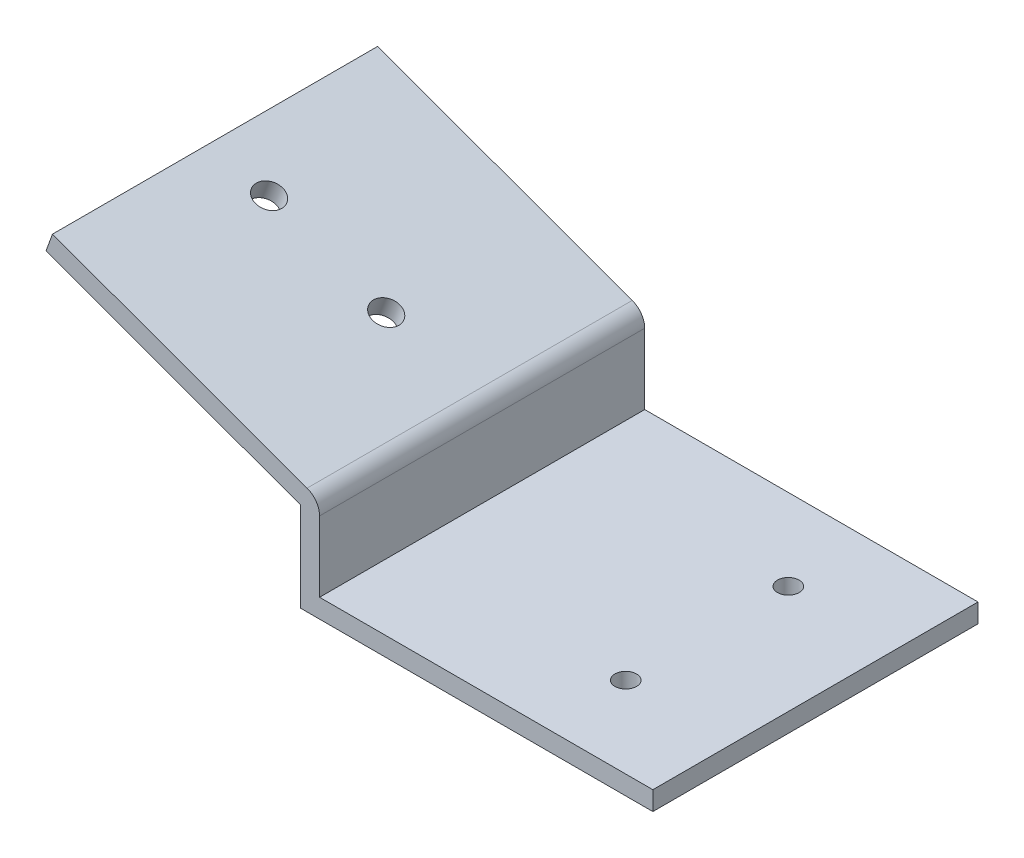
ISO-10303-21;
HEADER;
FILE_DESCRIPTION(('STEP AP214'),'2;1');
FILE_NAME('part.step','',(''),(''),'','','');
FILE_SCHEMA(('AUTOMOTIVE_DESIGN { 1 0 10303 214 1 1 1 1 }'));
ENDSEC;
DATA;
#1=APPLICATION_CONTEXT('core data for automotive mechanical design processes');
#2=APPLICATION_PROTOCOL_DEFINITION('international standard','automotive_design',2000,#1);
#3=PRODUCT_CONTEXT('',#1,'mechanical');
#4=PRODUCT('Part','Part','',(#3));
#5=PRODUCT_RELATED_PRODUCT_CATEGORY('part','',(#4));
#6=PRODUCT_DEFINITION_FORMATION('','',#4);
#7=PRODUCT_DEFINITION_CONTEXT('part definition',#1,'design');
#8=PRODUCT_DEFINITION('design','',#6,#7);
#9=PRODUCT_DEFINITION_SHAPE('','',#8);
#10=(LENGTH_UNIT() NAMED_UNIT(*) SI_UNIT(.MILLI.,.METRE.));
#11=(NAMED_UNIT(*) PLANE_ANGLE_UNIT() SI_UNIT($,.RADIAN.));
#12=(NAMED_UNIT(*) SI_UNIT($,.STERADIAN.) SOLID_ANGLE_UNIT());
#13=UNCERTAINTY_MEASURE_WITH_UNIT(LENGTH_MEASURE(1.E-05),#10,'distance_accuracy_value','');
#14=(GEOMETRIC_REPRESENTATION_CONTEXT(3) GLOBAL_UNCERTAINTY_ASSIGNED_CONTEXT((#13)) GLOBAL_UNIT_ASSIGNED_CONTEXT((#10,
#11,#12)) REPRESENTATION_CONTEXT('',''));
#15=CARTESIAN_POINT('',(0.,0.,0.));
#16=DIRECTION('',(0.,0.,1.));
#17=DIRECTION('',(1.,0.,0.));
#18=AXIS2_PLACEMENT_3D('',#15,#16,#17);
#19=CARTESIAN_POINT('',(0.,3.5,0.));
#20=DIRECTION('',(1.,0.,0.));
#21=DIRECTION('',(0.,0.,-1.));
#22=AXIS2_PLACEMENT_3D('',#19,#20,#21);
#23=PLANE('',#22);
#24=DIRECTION('',(0.,0.,1.));
#25=VECTOR('',#24,1.);
#26=CARTESIAN_POINT('',(0.,0.,0.));
#27=LINE('',#26,#25);
#28=CARTESIAN_POINT('',(0.,0.,0.));
#29=VERTEX_POINT('',#28);
#30=CARTESIAN_POINT('',(0.,0.,60.));
#31=VERTEX_POINT('',#30);
#32=EDGE_CURVE('E100',#29,#31,#27,.T.);
#33=ORIENTED_EDGE('',*,*,#32,.T.);
#34=DIRECTION('',(0.,-1.,0.));
#35=VECTOR('',#34,1.);
#36=CARTESIAN_POINT('',(0.,3.5,60.));
#37=LINE('',#36,#35);
#38=CARTESIAN_POINT('',(0.,16.5,60.));
#39=VERTEX_POINT('',#38);
#40=EDGE_CURVE('E11',#39,#31,#37,.T.);
#41=ORIENTED_EDGE('',*,*,#40,.F.);
#42=DIRECTION('',(0.,0.,1.));
#43=VECTOR('',#42,1.);
#44=CARTESIAN_POINT('',(0.,16.5,0.));
#45=LINE('',#44,#43);
#46=CARTESIAN_POINT('',(0.,16.5,0.));
#47=VERTEX_POINT('',#46);
#48=EDGE_CURVE('E102',#47,#39,#45,.T.);
#49=ORIENTED_EDGE('',*,*,#48,.F.);
#50=DIRECTION('',(0.,-1.,0.));
#51=VECTOR('',#50,1.);
#52=CARTESIAN_POINT('',(0.,3.5,0.));
#53=LINE('',#52,#51);
#54=EDGE_CURVE('E86',#47,#29,#53,.T.);
#55=ORIENTED_EDGE('',*,*,#54,.T.);
#56=EDGE_LOOP('',(#33,#41,#49,#55));
#57=FACE_BOUND('',#56,.T.);
#58=ADVANCED_FACE('F39',(#57),#23,.F.);
#59=CARTESIAN_POINT('',(0.,3.5,60.));
#60=DIRECTION('',(0.,0.,-1.));
#61=DIRECTION('',(-1.,0.,0.));
#62=AXIS2_PLACEMENT_3D('',#59,#60,#61);
#63=PLANE('',#62);
#64=DIRECTION('',(1.,0.,0.));
#65=VECTOR('',#64,1.);
#66=CARTESIAN_POINT('',(0.,0.,60.));
#67=LINE('',#66,#65);
#68=CARTESIAN_POINT('',(65.,0.,60.));
#69=VERTEX_POINT('',#68);
#70=EDGE_CURVE('E108',#31,#69,#67,.T.);
#71=ORIENTED_EDGE('',*,*,#70,.T.);
#72=DIRECTION('',(0.,-1.,0.));
#73=VECTOR('',#72,1.);
#74=CARTESIAN_POINT('',(65.,3.5,60.));
#75=LINE('',#74,#73);
#76=CARTESIAN_POINT('',(65.,3.5,60.));
#77=VERTEX_POINT('',#76);
#78=EDGE_CURVE('E48',#77,#69,#75,.T.);
#79=ORIENTED_EDGE('',*,*,#78,.F.);
#80=DIRECTION('',(1.,0.,0.));
#81=VECTOR('',#80,1.);
#82=CARTESIAN_POINT('',(0.,3.5,60.));
#83=LINE('',#82,#81);
#84=CARTESIAN_POINT('',(3.5,3.5,60.));
#85=VERTEX_POINT('',#84);
#86=EDGE_CURVE('E94',#85,#77,#83,.T.);
#87=ORIENTED_EDGE('',*,*,#86,.F.);
#88=DIRECTION('',(0.,-1.,0.));
#89=VECTOR('',#88,1.);
#90=CARTESIAN_POINT('',(3.50000000000001,16.5,60.));
#91=LINE('',#90,#89);
#92=CARTESIAN_POINT('',(3.50000000000001,16.5,60.));
#93=VERTEX_POINT('',#92);
#94=EDGE_CURVE('E110',#93,#85,#91,.T.);
#95=ORIENTED_EDGE('',*,*,#94,.F.);
#96=CARTESIAN_POINT('',(0.,16.5,60.));
#97=DIRECTION('',(0.,0.,1.));
#98=DIRECTION('',(-1.,0.,0.));
#99=AXIS2_PLACEMENT_3D('',#96,#97,#98);
#100=CIRCLE('',#99,3.50000000000002);
#101=CARTESIAN_POINT('',(1.19707050163985,19.7889241727507,60.));
#102=VERTEX_POINT('',#101);
#103=EDGE_CURVE('E136',#93,#102,#100,.T.);
#104=ORIENTED_EDGE('',*,*,#103,.T.);
#105=DIRECTION('',(-0.939692620785907,0.342020143325672,0.));
#106=VECTOR('',#105,1.);
#107=CARTESIAN_POINT('',(-45.7875605376555,36.8899313390343,60.));
#108=LINE('',#107,#106);
#109=CARTESIAN_POINT('',(-45.7875605376555,36.8899313390343,60.));
#110=VERTEX_POINT('',#109);
#111=EDGE_CURVE('E169',#102,#110,#108,.T.);
#112=ORIENTED_EDGE('',*,*,#111,.T.);
#113=DIRECTION('',(-0.342020143325673,-0.939692620785907,0.));
#114=VECTOR('',#113,1.);
#115=CARTESIAN_POINT('',(-46.9846310392954,33.6010071662836,60.));
#116=LINE('',#115,#114);
#117=CARTESIAN_POINT('',(-46.9846310392954,33.6010071662836,60.));
#118=VERTEX_POINT('',#117);
#119=EDGE_CURVE('E173',#110,#118,#116,.T.);
#120=ORIENTED_EDGE('',*,*,#119,.T.);
#121=DIRECTION('',(0.939692620785907,-0.342020143325673,0.));
#122=VECTOR('',#121,1.);
#123=CARTESIAN_POINT('',(0.,16.5,60.));
#124=LINE('',#123,#122);
#125=EDGE_CURVE('E154',#118,#39,#124,.T.);
#126=ORIENTED_EDGE('',*,*,#125,.T.);
#127=ORIENTED_EDGE('',*,*,#40,.T.);
#128=EDGE_LOOP('',(#71,#79,#87,#95,#104,#112,#120,#126,#127));
#129=FACE_BOUND('',#128,.T.);
#130=ADVANCED_FACE('F246',(#129),#63,.F.);
#131=CARTESIAN_POINT('',(65.,3.5,0.));
#132=DIRECTION('',(-1.,0.,0.));
#133=DIRECTION('',(0.,0.,1.));
#134=AXIS2_PLACEMENT_3D('',#131,#132,#133);
#135=PLANE('',#134);
#136=DIRECTION('',(0.,0.,-1.));
#137=VECTOR('',#136,1.);
#138=CARTESIAN_POINT('',(65.,0.,0.));
#139=LINE('',#138,#137);
#140=CARTESIAN_POINT('',(65.,0.,0.));
#141=VERTEX_POINT('',#140);
#142=EDGE_CURVE('E95',#69,#141,#139,.T.);
#143=ORIENTED_EDGE('',*,*,#142,.T.);
#144=DIRECTION('',(0.,-1.,0.));
#145=VECTOR('',#144,1.);
#146=CARTESIAN_POINT('',(65.,3.5,0.));
#147=LINE('',#146,#145);
#148=CARTESIAN_POINT('',(65.,3.5,0.));
#149=VERTEX_POINT('',#148);
#150=EDGE_CURVE('E89',#149,#141,#147,.T.);
#151=ORIENTED_EDGE('',*,*,#150,.F.);
#152=DIRECTION('',(0.,0.,-1.));
#153=VECTOR('',#152,1.);
#154=CARTESIAN_POINT('',(65.,3.5,0.));
#155=LINE('',#154,#153);
#156=EDGE_CURVE('E62',#77,#149,#155,.T.);
#157=ORIENTED_EDGE('',*,*,#156,.F.);
#158=ORIENTED_EDGE('',*,*,#78,.T.);
#159=EDGE_LOOP('',(#143,#151,#157,#158));
#160=FACE_BOUND('',#159,.T.);
#161=ADVANCED_FACE('F253',(#160),#135,.F.);
#162=CARTESIAN_POINT('',(0.,3.5,0.));
#163=DIRECTION('',(0.,0.,1.));
#164=DIRECTION('',(1.,0.,0.));
#165=AXIS2_PLACEMENT_3D('',#162,#163,#164);
#166=PLANE('',#165);
#167=DIRECTION('',(-1.,0.,0.));
#168=VECTOR('',#167,1.);
#169=CARTESIAN_POINT('',(0.,0.,0.));
#170=LINE('',#169,#168);
#171=EDGE_CURVE('E82',#141,#29,#170,.T.);
#172=ORIENTED_EDGE('',*,*,#171,.T.);
#173=ORIENTED_EDGE('',*,*,#54,.F.);
#174=DIRECTION('',(0.939692620785907,-0.342020143325673,0.));
#175=VECTOR('',#174,1.);
#176=CARTESIAN_POINT('',(0.,16.5,0.));
#177=LINE('',#176,#175);
#178=CARTESIAN_POINT('',(-46.9846310392954,33.6010071662836,0.));
#179=VERTEX_POINT('',#178);
#180=EDGE_CURVE('E162',#179,#47,#177,.T.);
#181=ORIENTED_EDGE('',*,*,#180,.F.);
#182=DIRECTION('',(-0.342020143325673,-0.939692620785907,0.));
#183=VECTOR('',#182,1.);
#184=CARTESIAN_POINT('',(-46.9846310392954,33.6010071662836,0.));
#185=LINE('',#184,#183);
#186=CARTESIAN_POINT('',(-45.7875605376555,36.8899313390343,0.));
#187=VERTEX_POINT('',#186);
#188=EDGE_CURVE('E158',#187,#179,#185,.T.);
#189=ORIENTED_EDGE('',*,*,#188,.F.);
#190=DIRECTION('',(-0.939692620785907,0.342020143325672,0.));
#191=VECTOR('',#190,1.);
#192=CARTESIAN_POINT('',(-45.7875605376555,36.8899313390343,0.));
#193=LINE('',#192,#191);
#194=CARTESIAN_POINT('',(1.19707050163985,19.7889241727507,0.));
#195=VERTEX_POINT('',#194);
#196=EDGE_CURVE('E153',#195,#187,#193,.T.);
#197=ORIENTED_EDGE('',*,*,#196,.F.);
#198=CARTESIAN_POINT('',(0.,16.5,0.));
#199=DIRECTION('',(0.,0.,1.));
#200=DIRECTION('',(-1.,0.,0.));
#201=AXIS2_PLACEMENT_3D('',#198,#199,#200);
#202=CIRCLE('',#201,3.50000000000002);
#203=CARTESIAN_POINT('',(3.5,16.5,0.));
#204=VERTEX_POINT('',#203);
#205=EDGE_CURVE('E149',#204,#195,#202,.T.);
#206=ORIENTED_EDGE('',*,*,#205,.F.);
#207=DIRECTION('',(0.,-1.,0.));
#208=VECTOR('',#207,1.);
#209=CARTESIAN_POINT('',(3.5,16.5,0.));
#210=LINE('',#209,#208);
#211=CARTESIAN_POINT('',(3.5,3.5,0.));
#212=VERTEX_POINT('',#211);
#213=EDGE_CURVE('E116',#204,#212,#210,.T.);
#214=ORIENTED_EDGE('',*,*,#213,.T.);
#215=DIRECTION('',(-1.,0.,0.));
#216=VECTOR('',#215,1.);
#217=CARTESIAN_POINT('',(0.,3.5,0.));
#218=LINE('',#217,#216);
#219=EDGE_CURVE('E105',#149,#212,#218,.T.);
#220=ORIENTED_EDGE('',*,*,#219,.F.);
#221=ORIENTED_EDGE('',*,*,#150,.T.);
#222=EDGE_LOOP('',(#172,#173,#181,#189,#197,#206,#214,#220,#221));
#223=FACE_BOUND('',#222,.T.);
#224=ADVANCED_FACE('F84',(#223),#166,.F.);
#225=CARTESIAN_POINT('',(0.,3.5,0.));
#226=DIRECTION('',(0.,1.,0.));
#227=DIRECTION('',(0.,0.,1.));
#228=AXIS2_PLACEMENT_3D('',#225,#226,#227);
#229=PLANE('',#228);
#230=CARTESIAN_POINT('',(45.,3.5,15.));
#231=DIRECTION('',(0.,1.,0.));
#232=DIRECTION('',(0.,0.,1.));
#233=AXIS2_PLACEMENT_3D('',#230,#231,#232);
#234=CIRCLE('',#233,2.);
#235=CARTESIAN_POINT('',(45.,3.5,17.));
#236=VERTEX_POINT('',#235);
#237=EDGE_CURVE('E130',#236,#236,#234,.T.);
#238=ORIENTED_EDGE('',*,*,#237,.F.);
#239=EDGE_LOOP('',(#238));
#240=FACE_BOUND('',#239,.T.);
#241=CARTESIAN_POINT('',(45.,3.5,45.));
#242=DIRECTION('',(0.,1.,0.));
#243=DIRECTION('',(0.,0.,1.));
#244=AXIS2_PLACEMENT_3D('',#241,#242,#243);
#245=CIRCLE('',#244,2.);
#246=CARTESIAN_POINT('',(45.,3.5,47.));
#247=VERTEX_POINT('',#246);
#248=EDGE_CURVE('E138',#247,#247,#245,.T.);
#249=ORIENTED_EDGE('',*,*,#248,.F.);
#250=EDGE_LOOP('',(#249));
#251=FACE_BOUND('',#250,.T.);
#252=DIRECTION('',(0.,0.,-1.));
#253=VECTOR('',#252,1.);
#254=CARTESIAN_POINT('',(3.5,3.5,0.));
#255=LINE('',#254,#253);
#256=EDGE_CURVE('E56',#85,#212,#255,.T.);
#257=ORIENTED_EDGE('',*,*,#256,.F.);
#258=ORIENTED_EDGE('',*,*,#86,.T.);
#259=ORIENTED_EDGE('',*,*,#156,.T.);
#260=ORIENTED_EDGE('',*,*,#219,.T.);
#261=EDGE_LOOP('',(#257,#258,#259,#260));
#262=FACE_BOUND('',#261,.T.);
#263=ADVANCED_FACE('F206',(#240,#251,#262),#229,.T.);
#264=CARTESIAN_POINT('',(0.,0.,0.));
#265=DIRECTION('',(0.,1.,0.));
#266=DIRECTION('',(0.,0.,1.));
#267=AXIS2_PLACEMENT_3D('',#264,#265,#266);
#268=PLANE('',#267);
#269=CARTESIAN_POINT('',(45.,0.,15.));
#270=DIRECTION('',(0.,1.,0.));
#271=DIRECTION('',(0.,0.,1.));
#272=AXIS2_PLACEMENT_3D('',#269,#270,#271);
#273=CIRCLE('',#272,2.);
#274=CARTESIAN_POINT('',(45.,0.,17.));
#275=VERTEX_POINT('',#274);
#276=EDGE_CURVE('E42',#275,#275,#273,.T.);
#277=ORIENTED_EDGE('',*,*,#276,.T.);
#278=EDGE_LOOP('',(#277));
#279=FACE_BOUND('',#278,.T.);
#280=CARTESIAN_POINT('',(45.,0.,45.));
#281=DIRECTION('',(0.,1.,0.));
#282=DIRECTION('',(0.,0.,1.));
#283=AXIS2_PLACEMENT_3D('',#280,#281,#282);
#284=CIRCLE('',#283,2.);
#285=CARTESIAN_POINT('',(45.,0.,47.));
#286=VERTEX_POINT('',#285);
#287=EDGE_CURVE('E127',#286,#286,#284,.T.);
#288=ORIENTED_EDGE('',*,*,#287,.T.);
#289=EDGE_LOOP('',(#288));
#290=FACE_BOUND('',#289,.T.);
#291=ORIENTED_EDGE('',*,*,#32,.F.);
#292=ORIENTED_EDGE('',*,*,#171,.F.);
#293=ORIENTED_EDGE('',*,*,#142,.F.);
#294=ORIENTED_EDGE('',*,*,#70,.F.);
#295=EDGE_LOOP('',(#291,#292,#293,#294));
#296=FACE_BOUND('',#295,.T.);
#297=ADVANCED_FACE('F107',(#279,#290,#296),#268,.F.);
#298=CARTESIAN_POINT('',(3.5,16.5,0.));
#299=DIRECTION('',(-1.,0.,0.));
#300=DIRECTION('',(0.,0.,1.));
#301=AXIS2_PLACEMENT_3D('',#298,#299,#300);
#302=PLANE('',#301);
#303=ORIENTED_EDGE('',*,*,#256,.T.);
#304=ORIENTED_EDGE('',*,*,#213,.F.);
#305=DIRECTION('',(0.,0.,-1.));
#306=VECTOR('',#305,1.);
#307=CARTESIAN_POINT('',(3.5,16.5,0.));
#308=LINE('',#307,#306);
#309=EDGE_CURVE('E193',#93,#204,#308,.T.);
#310=ORIENTED_EDGE('',*,*,#309,.F.);
#311=ORIENTED_EDGE('',*,*,#94,.T.);
#312=EDGE_LOOP('',(#303,#304,#310,#311));
#313=FACE_BOUND('',#312,.T.);
#314=ADVANCED_FACE('F211',(#313),#302,.F.);
#315=CARTESIAN_POINT('',(0.,16.5,0.));
#316=DIRECTION('',(-0.342020143325672,-0.939692620785907,0.));
#317=DIRECTION('',(0.939692620785907,-0.342020143325672,0.));
#318=AXIS2_PLACEMENT_3D('',#315,#316,#317);
#319=PLANE('',#318);
#320=CARTESIAN_POINT('',(-15.2191688728327,22.0393244599819,30.1812288760336));
#321=DIRECTION('',(-0.342020143325672,-0.939692620785907,0.));
#322=DIRECTION('',(0.939692620785907,-0.342020143325672,0.));
#323=AXIS2_PLACEMENT_3D('',#320,#321,#322);
#324=CIRCLE('',#323,2.5);
#325=CARTESIAN_POINT('',(-12.869937320868,21.1842741016677,30.1812288760336));
#326=VERTEX_POINT('',#325);
#327=EDGE_CURVE('E144',#326,#326,#324,.T.);
#328=ORIENTED_EDGE('',*,*,#327,.F.);
#329=EDGE_LOOP('',(#328));
#330=FACE_BOUND('',#329,.T.);
#331=CARTESIAN_POINT('',(-36.8320991509086,29.9057877564724,30.1812288760336));
#332=DIRECTION('',(-0.342020143325672,-0.939692620785907,0.));
#333=DIRECTION('',(0.939692620785907,-0.342020143325672,0.));
#334=AXIS2_PLACEMENT_3D('',#331,#332,#333);
#335=CIRCLE('',#334,2.5);
#336=CARTESIAN_POINT('',(-34.4828675989438,29.0507373981582,30.1812288760336));
#337=VERTEX_POINT('',#336);
#338=EDGE_CURVE('E391',#337,#337,#335,.T.);
#339=ORIENTED_EDGE('',*,*,#338,.F.);
#340=EDGE_LOOP('',(#339));
#341=FACE_BOUND('',#340,.T.);
#342=ORIENTED_EDGE('',*,*,#125,.F.);
#343=DIRECTION('',(0.,0.,1.));
#344=VECTOR('',#343,1.);
#345=CARTESIAN_POINT('',(-46.9846310392954,33.6010071662836,0.));
#346=LINE('',#345,#344);
#347=EDGE_CURVE('E180',#179,#118,#346,.T.);
#348=ORIENTED_EDGE('',*,*,#347,.F.);
#349=ORIENTED_EDGE('',*,*,#180,.T.);
#350=ORIENTED_EDGE('',*,*,#48,.T.);
#351=EDGE_LOOP('',(#342,#348,#349,#350));
#352=FACE_BOUND('',#351,.T.);
#353=ADVANCED_FACE('F245',(#330,#341,#352),#319,.T.);
#354=CARTESIAN_POINT('',(-46.9846310392954,33.6010071662836,0.));
#355=DIRECTION('',(-0.939692620785907,0.342020143325673,0.));
#356=DIRECTION('',(-0.342020143325673,-0.939692620785907,0.));
#357=AXIS2_PLACEMENT_3D('',#354,#355,#356);
#358=PLANE('',#357);
#359=ORIENTED_EDGE('',*,*,#119,.F.);
#360=DIRECTION('',(0.,0.,1.));
#361=VECTOR('',#360,1.);
#362=CARTESIAN_POINT('',(-45.7875605376555,36.8899313390343,0.));
#363=LINE('',#362,#361);
#364=EDGE_CURVE('E184',#187,#110,#363,.T.);
#365=ORIENTED_EDGE('',*,*,#364,.F.);
#366=ORIENTED_EDGE('',*,*,#188,.T.);
#367=ORIENTED_EDGE('',*,*,#347,.T.);
#368=EDGE_LOOP('',(#359,#365,#366,#367));
#369=FACE_BOUND('',#368,.T.);
#370=ADVANCED_FACE('F249',(#369),#358,.T.);
#371=CARTESIAN_POINT('',(-45.7875605376555,36.8899313390343,0.));
#372=DIRECTION('',(0.342020143325672,0.939692620785907,0.));
#373=DIRECTION('',(-0.939692620785907,0.342020143325672,0.));
#374=AXIS2_PLACEMENT_3D('',#371,#372,#373);
#375=PLANE('',#374);
#376=CARTESIAN_POINT('',(-14.0220983711929,25.3282486327326,30.1812288760336));
#377=DIRECTION('',(0.342020143325672,0.939692620785907,0.));
#378=DIRECTION('',(-0.939692620785907,0.342020143325672,0.));
#379=AXIS2_PLACEMENT_3D('',#376,#377,#378);
#380=CIRCLE('',#379,2.5);
#381=CARTESIAN_POINT('',(-16.3713299231576,26.1832989910468,30.1812288760336));
#382=VERTEX_POINT('',#381);
#383=EDGE_CURVE('E385',#382,#382,#380,.T.);
#384=ORIENTED_EDGE('',*,*,#383,.F.);
#385=EDGE_LOOP('',(#384));
#386=FACE_BOUND('',#385,.T.);
#387=CARTESIAN_POINT('',(-35.6350286492687,33.194711929223,30.1812288760336));
#388=DIRECTION('',(0.342020143325672,0.939692620785907,0.));
#389=DIRECTION('',(-0.939692620785907,0.342020143325672,0.));
#390=AXIS2_PLACEMENT_3D('',#387,#388,#389);
#391=CIRCLE('',#390,2.5);
#392=CARTESIAN_POINT('',(-37.9842602012335,34.0497622875372,30.1812288760336));
#393=VERTEX_POINT('',#392);
#394=EDGE_CURVE('E387',#393,#393,#391,.T.);
#395=ORIENTED_EDGE('',*,*,#394,.F.);
#396=EDGE_LOOP('',(#395));
#397=FACE_BOUND('',#396,.T.);
#398=ORIENTED_EDGE('',*,*,#111,.F.);
#399=DIRECTION('',(0.,0.,1.));
#400=VECTOR('',#399,1.);
#401=CARTESIAN_POINT('',(1.19707050163985,19.7889241727507,0.));
#402=LINE('',#401,#400);
#403=EDGE_CURVE('E165',#195,#102,#402,.T.);
#404=ORIENTED_EDGE('',*,*,#403,.F.);
#405=ORIENTED_EDGE('',*,*,#196,.T.);
#406=ORIENTED_EDGE('',*,*,#364,.T.);
#407=EDGE_LOOP('',(#398,#404,#405,#406));
#408=FACE_BOUND('',#407,.T.);
#409=ADVANCED_FACE('F250',(#386,#397,#408),#375,.T.);
#410=CARTESIAN_POINT('',(0.,16.5,0.));
#411=DIRECTION('',(0.,0.,1.));
#412=DIRECTION('',(1.,0.,0.));
#413=AXIS2_PLACEMENT_3D('',#410,#411,#412);
#414=CYLINDRICAL_SURFACE('',#413,3.50000000000002);
#415=ORIENTED_EDGE('',*,*,#103,.F.);
#416=ORIENTED_EDGE('',*,*,#309,.T.);
#417=ORIENTED_EDGE('',*,*,#205,.T.);
#418=ORIENTED_EDGE('',*,*,#403,.T.);
#419=EDGE_LOOP('',(#415,#416,#417,#418));
#420=FACE_BOUND('',#419,.T.);
#421=ADVANCED_FACE('F222',(#420),#414,.T.);
#422=CARTESIAN_POINT('',(45.,-56.5,45.));
#423=DIRECTION('',(0.,1.,0.));
#424=DIRECTION('',(0.,0.,1.));
#425=AXIS2_PLACEMENT_3D('',#422,#423,#424);
#426=CYLINDRICAL_SURFACE('',#425,2.);
#427=ORIENTED_EDGE('',*,*,#248,.T.);
#428=EDGE_LOOP('',(#427));
#429=FACE_BOUND('',#428,.T.);
#430=ORIENTED_EDGE('',*,*,#287,.F.);
#431=EDGE_LOOP('',(#430));
#432=FACE_BOUND('',#431,.T.);
#433=ADVANCED_FACE('F307',(#429,#432),#426,.F.);
#434=CARTESIAN_POINT('',(45.,-56.5,15.));
#435=DIRECTION('',(0.,1.,0.));
#436=DIRECTION('',(0.,0.,1.));
#437=AXIS2_PLACEMENT_3D('',#434,#435,#436);
#438=CYLINDRICAL_SURFACE('',#437,2.);
#439=ORIENTED_EDGE('',*,*,#237,.T.);
#440=EDGE_LOOP('',(#439));
#441=FACE_BOUND('',#440,.T.);
#442=ORIENTED_EDGE('',*,*,#276,.F.);
#443=EDGE_LOOP('',(#442));
#444=FACE_BOUND('',#443,.T.);
#445=ADVANCED_FACE('F333',(#441,#444),#438,.F.);
#446=CARTESIAN_POINT('',(-56.1562372488091,-23.1868453179314,30.1812288760336));
#447=DIRECTION('',(0.342020143325672,0.939692620785907,0.));
#448=DIRECTION('',(-0.939692620785907,0.342020143325672,0.));
#449=AXIS2_PLACEMENT_3D('',#446,#447,#448);
#450=CYLINDRICAL_SURFACE('',#449,2.5);
#451=ORIENTED_EDGE('',*,*,#338,.T.);
#452=EDGE_LOOP('',(#451));
#453=FACE_BOUND('',#452,.T.);
#454=ORIENTED_EDGE('',*,*,#394,.T.);
#455=EDGE_LOOP('',(#454));
#456=FACE_BOUND('',#455,.T.);
#457=ADVANCED_FACE('F343',(#453,#456),#450,.F.);
#458=CARTESIAN_POINT('',(-34.5433069707332,-31.0533086144218,30.1812288760336));
#459=DIRECTION('',(0.342020143325672,0.939692620785907,0.));
#460=DIRECTION('',(-0.939692620785907,0.342020143325672,0.));
#461=AXIS2_PLACEMENT_3D('',#458,#459,#460);
#462=CYLINDRICAL_SURFACE('',#461,2.5);
#463=ORIENTED_EDGE('',*,*,#327,.T.);
#464=EDGE_LOOP('',(#463));
#465=FACE_BOUND('',#464,.T.);
#466=ORIENTED_EDGE('',*,*,#383,.T.);
#467=EDGE_LOOP('',(#466));
#468=FACE_BOUND('',#467,.T.);
#469=ADVANCED_FACE('F366',(#465,#468),#462,.F.);
#470=CLOSED_SHELL('',(#58,#130,#161,#224,#263,#297,#314,#353,#370,#409,#421,#433,#445,#457,#469));
#471=MANIFOLD_SOLID_BREP('B2',#470);
#472=ADVANCED_BREP_SHAPE_REPRESENTATION('',(#18,#471),#14);
#473=SHAPE_DEFINITION_REPRESENTATION(#9,#472);
ENDSEC;
END-ISO-10303-21;
